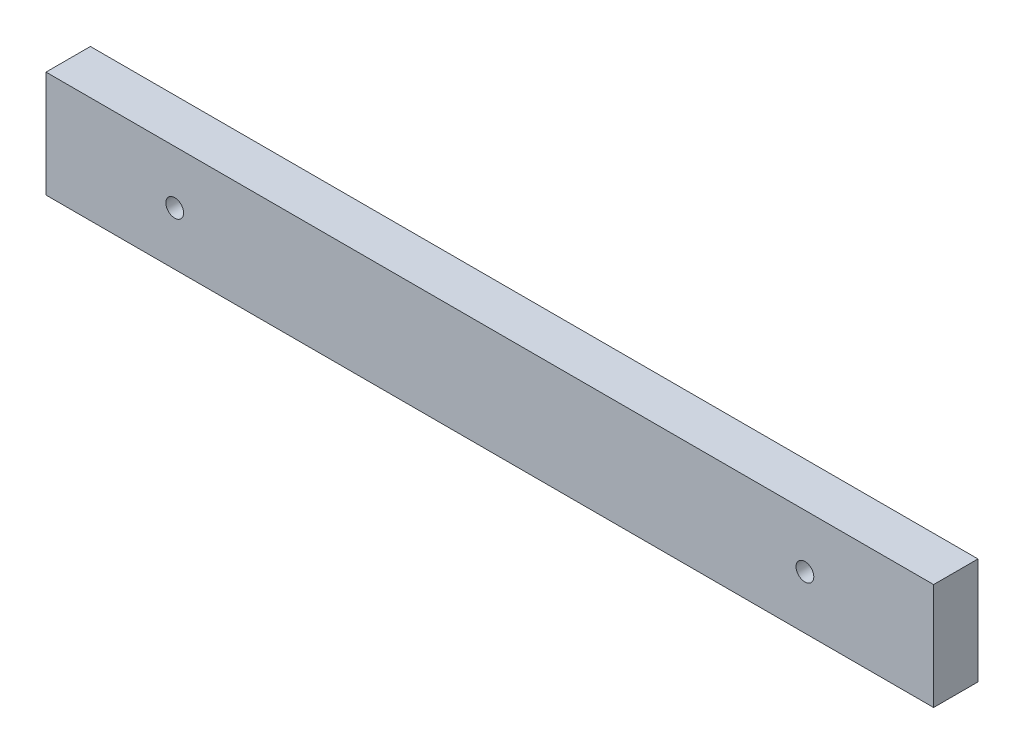
ISO-10303-21;
HEADER;
FILE_DESCRIPTION(('STEP AP214'),'2;1');
FILE_NAME('part.step','',(''),(''),'','','');
FILE_SCHEMA(('AUTOMOTIVE_DESIGN { 1 0 10303 214 1 1 1 1 }'));
ENDSEC;
DATA;
#1=APPLICATION_CONTEXT('core data for automotive mechanical design processes');
#2=APPLICATION_PROTOCOL_DEFINITION('international standard','automotive_design',2000,#1);
#3=PRODUCT_CONTEXT('',#1,'mechanical');
#4=PRODUCT('Part','Part','',(#3));
#5=PRODUCT_RELATED_PRODUCT_CATEGORY('part','',(#4));
#6=PRODUCT_DEFINITION_FORMATION('','',#4);
#7=PRODUCT_DEFINITION_CONTEXT('part definition',#1,'design');
#8=PRODUCT_DEFINITION('design','',#6,#7);
#9=PRODUCT_DEFINITION_SHAPE('','',#8);
#10=(LENGTH_UNIT() NAMED_UNIT(*) SI_UNIT(.MILLI.,.METRE.));
#11=(NAMED_UNIT(*) PLANE_ANGLE_UNIT() SI_UNIT($,.RADIAN.));
#12=(NAMED_UNIT(*) SI_UNIT($,.STERADIAN.) SOLID_ANGLE_UNIT());
#13=UNCERTAINTY_MEASURE_WITH_UNIT(LENGTH_MEASURE(1.E-05),#10,'distance_accuracy_value','');
#14=(GEOMETRIC_REPRESENTATION_CONTEXT(3) GLOBAL_UNCERTAINTY_ASSIGNED_CONTEXT((#13)) GLOBAL_UNIT_ASSIGNED_CONTEXT((#10,
#11,#12)) REPRESENTATION_CONTEXT('',''));
#15=CARTESIAN_POINT('',(0.,0.,0.));
#16=DIRECTION('',(0.,0.,1.));
#17=DIRECTION('',(1.,0.,0.));
#18=AXIS2_PLACEMENT_3D('',#15,#16,#17);
#19=CARTESIAN_POINT('',(0.,0.,5.));
#20=DIRECTION('',(1.,0.,0.));
#21=DIRECTION('',(0.,0.,-1.));
#22=AXIS2_PLACEMENT_3D('',#19,#20,#21);
#23=PLANE('',#22);
#24=DIRECTION('',(0.,-1.,0.));
#25=VECTOR('',#24,1.);
#26=CARTESIAN_POINT('',(0.,0.,0.));
#27=LINE('',#26,#25);
#28=CARTESIAN_POINT('',(0.,12.,0.));
#29=VERTEX_POINT('',#28);
#30=CARTESIAN_POINT('',(0.,0.,0.));
#31=VERTEX_POINT('',#30);
#32=EDGE_CURVE('E96',#29,#31,#27,.T.);
#33=ORIENTED_EDGE('',*,*,#32,.T.);
#34=DIRECTION('',(0.,0.,-1.));
#35=VECTOR('',#34,1.);
#36=CARTESIAN_POINT('',(0.,0.,5.));
#37=LINE('',#36,#35);
#38=CARTESIAN_POINT('',(0.,0.,5.));
#39=VERTEX_POINT('',#38);
#40=EDGE_CURVE('E11',#39,#31,#37,.T.);
#41=ORIENTED_EDGE('',*,*,#40,.F.);
#42=DIRECTION('',(0.,-1.,0.));
#43=VECTOR('',#42,1.);
#44=CARTESIAN_POINT('',(0.,0.,5.));
#45=LINE('',#44,#43);
#46=CARTESIAN_POINT('',(0.,12.,5.));
#47=VERTEX_POINT('',#46);
#48=EDGE_CURVE('E84',#47,#39,#45,.T.);
#49=ORIENTED_EDGE('',*,*,#48,.F.);
#50=DIRECTION('',(0.,0.,-1.));
#51=VECTOR('',#50,1.);
#52=CARTESIAN_POINT('',(0.,12.,5.));
#53=LINE('',#52,#51);
#54=EDGE_CURVE('E92',#47,#29,#53,.T.);
#55=ORIENTED_EDGE('',*,*,#54,.T.);
#56=EDGE_LOOP('',(#33,#41,#49,#55));
#57=FACE_BOUND('',#56,.T.);
#58=ADVANCED_FACE('F33',(#57),#23,.F.);
#59=CARTESIAN_POINT('',(0.,0.,5.));
#60=DIRECTION('',(0.,1.,0.));
#61=DIRECTION('',(0.,0.,1.));
#62=AXIS2_PLACEMENT_3D('',#59,#60,#61);
#63=PLANE('',#62);
#64=DIRECTION('',(1.,0.,0.));
#65=VECTOR('',#64,1.);
#66=CARTESIAN_POINT('',(0.,0.,0.));
#67=LINE('',#66,#65);
#68=CARTESIAN_POINT('',(100.,0.,0.));
#69=VERTEX_POINT('',#68);
#70=EDGE_CURVE('E88',#31,#69,#67,.T.);
#71=ORIENTED_EDGE('',*,*,#70,.T.);
#72=DIRECTION('',(0.,0.,-1.));
#73=VECTOR('',#72,1.);
#74=CARTESIAN_POINT('',(100.,0.,5.));
#75=LINE('',#74,#73);
#76=CARTESIAN_POINT('',(100.,0.,5.));
#77=VERTEX_POINT('',#76);
#78=EDGE_CURVE('E41',#77,#69,#75,.T.);
#79=ORIENTED_EDGE('',*,*,#78,.F.);
#80=DIRECTION('',(1.,0.,0.));
#81=VECTOR('',#80,1.);
#82=CARTESIAN_POINT('',(0.,0.,5.));
#83=LINE('',#82,#81);
#84=EDGE_CURVE('E79',#39,#77,#83,.T.);
#85=ORIENTED_EDGE('',*,*,#84,.F.);
#86=ORIENTED_EDGE('',*,*,#40,.T.);
#87=EDGE_LOOP('',(#71,#79,#85,#86));
#88=FACE_BOUND('',#87,.T.);
#89=ADVANCED_FACE('F87',(#88),#63,.F.);
#90=CARTESIAN_POINT('',(100.,0.,5.));
#91=DIRECTION('',(-1.,0.,0.));
#92=DIRECTION('',(0.,0.,1.));
#93=AXIS2_PLACEMENT_3D('',#90,#91,#92);
#94=PLANE('',#93);
#95=DIRECTION('',(0.,1.,0.));
#96=VECTOR('',#95,1.);
#97=CARTESIAN_POINT('',(100.,0.,0.));
#98=LINE('',#97,#96);
#99=CARTESIAN_POINT('',(100.,12.,0.));
#100=VERTEX_POINT('',#99);
#101=EDGE_CURVE('E66',#69,#100,#98,.T.);
#102=ORIENTED_EDGE('',*,*,#101,.T.);
#103=DIRECTION('',(0.,0.,-1.));
#104=VECTOR('',#103,1.);
#105=CARTESIAN_POINT('',(100.,12.,5.));
#106=LINE('',#105,#104);
#107=CARTESIAN_POINT('',(100.,12.,5.));
#108=VERTEX_POINT('',#107);
#109=EDGE_CURVE('E89',#108,#100,#106,.T.);
#110=ORIENTED_EDGE('',*,*,#109,.F.);
#111=DIRECTION('',(0.,1.,0.));
#112=VECTOR('',#111,1.);
#113=CARTESIAN_POINT('',(100.,0.,5.));
#114=LINE('',#113,#112);
#115=EDGE_CURVE('E82',#77,#108,#114,.T.);
#116=ORIENTED_EDGE('',*,*,#115,.F.);
#117=ORIENTED_EDGE('',*,*,#78,.T.);
#118=EDGE_LOOP('',(#102,#110,#116,#117));
#119=FACE_BOUND('',#118,.T.);
#120=ADVANCED_FACE('F90',(#119),#94,.F.);
#121=CARTESIAN_POINT('',(0.,12.,5.));
#122=DIRECTION('',(0.,-1.,0.));
#123=DIRECTION('',(0.,0.,-1.));
#124=AXIS2_PLACEMENT_3D('',#121,#122,#123);
#125=PLANE('',#124);
#126=DIRECTION('',(-1.,0.,0.));
#127=VECTOR('',#126,1.);
#128=CARTESIAN_POINT('',(0.,12.,0.));
#129=LINE('',#128,#127);
#130=EDGE_CURVE('E72',#100,#29,#129,.T.);
#131=ORIENTED_EDGE('',*,*,#130,.T.);
#132=ORIENTED_EDGE('',*,*,#54,.F.);
#133=DIRECTION('',(-1.,0.,0.));
#134=VECTOR('',#133,1.);
#135=CARTESIAN_POINT('',(0.,12.,5.));
#136=LINE('',#135,#134);
#137=EDGE_CURVE('E49',#108,#47,#136,.T.);
#138=ORIENTED_EDGE('',*,*,#137,.F.);
#139=ORIENTED_EDGE('',*,*,#109,.T.);
#140=EDGE_LOOP('',(#131,#132,#138,#139));
#141=FACE_BOUND('',#140,.T.);
#142=ADVANCED_FACE('F104',(#141),#125,.F.);
#143=CARTESIAN_POINT('',(0.,0.,5.));
#144=DIRECTION('',(0.,0.,-1.));
#145=DIRECTION('',(-1.,0.,0.));
#146=AXIS2_PLACEMENT_3D('',#143,#144,#145);
#147=PLANE('',#146);
#148=CARTESIAN_POINT('',(14.5,6.,5.));
#149=DIRECTION('',(0.,0.,1.));
#150=DIRECTION('',(1.,0.,0.));
#151=AXIS2_PLACEMENT_3D('',#148,#149,#150);
#152=CIRCLE('',#151,1.);
#153=CARTESIAN_POINT('',(15.5,6.,5.));
#154=VERTEX_POINT('',#153);
#155=EDGE_CURVE('E116',#154,#154,#152,.T.);
#156=ORIENTED_EDGE('',*,*,#155,.F.);
#157=EDGE_LOOP('',(#156));
#158=FACE_BOUND('',#157,.T.);
#159=CARTESIAN_POINT('',(85.5,6.00000000000001,5.));
#160=DIRECTION('',(0.,0.,1.));
#161=DIRECTION('',(1.,0.,0.));
#162=AXIS2_PLACEMENT_3D('',#159,#160,#161);
#163=CIRCLE('',#162,0.999999999999998);
#164=CARTESIAN_POINT('',(86.5,6.00000000000001,5.));
#165=VERTEX_POINT('',#164);
#166=EDGE_CURVE('E110',#165,#165,#163,.T.);
#167=ORIENTED_EDGE('',*,*,#166,.F.);
#168=EDGE_LOOP('',(#167));
#169=FACE_BOUND('',#168,.T.);
#170=ORIENTED_EDGE('',*,*,#48,.T.);
#171=ORIENTED_EDGE('',*,*,#84,.T.);
#172=ORIENTED_EDGE('',*,*,#115,.T.);
#173=ORIENTED_EDGE('',*,*,#137,.T.);
#174=EDGE_LOOP('',(#170,#171,#172,#173));
#175=FACE_BOUND('',#174,.T.);
#176=ADVANCED_FACE('F80',(#158,#169,#175),#147,.F.);
#177=CARTESIAN_POINT('',(0.,0.,0.));
#178=DIRECTION('',(0.,0.,-1.));
#179=DIRECTION('',(-1.,0.,0.));
#180=AXIS2_PLACEMENT_3D('',#177,#178,#179);
#181=PLANE('',#180);
#182=CARTESIAN_POINT('',(14.5,6.,0.));
#183=DIRECTION('',(0.,0.,1.));
#184=DIRECTION('',(1.,0.,0.));
#185=AXIS2_PLACEMENT_3D('',#182,#183,#184);
#186=CIRCLE('',#185,1.);
#187=CARTESIAN_POINT('',(15.5,6.,0.));
#188=VERTEX_POINT('',#187);
#189=EDGE_CURVE('E99',#188,#188,#186,.T.);
#190=ORIENTED_EDGE('',*,*,#189,.T.);
#191=EDGE_LOOP('',(#190));
#192=FACE_BOUND('',#191,.T.);
#193=CARTESIAN_POINT('',(85.5,6.00000000000001,0.));
#194=DIRECTION('',(0.,0.,1.));
#195=DIRECTION('',(1.,0.,0.));
#196=AXIS2_PLACEMENT_3D('',#193,#194,#195);
#197=CIRCLE('',#196,0.999999999999998);
#198=CARTESIAN_POINT('',(86.5,6.00000000000001,0.));
#199=VERTEX_POINT('',#198);
#200=EDGE_CURVE('E113',#199,#199,#197,.T.);
#201=ORIENTED_EDGE('',*,*,#200,.T.);
#202=EDGE_LOOP('',(#201));
#203=FACE_BOUND('',#202,.T.);
#204=ORIENTED_EDGE('',*,*,#32,.F.);
#205=ORIENTED_EDGE('',*,*,#130,.F.);
#206=ORIENTED_EDGE('',*,*,#101,.F.);
#207=ORIENTED_EDGE('',*,*,#70,.F.);
#208=EDGE_LOOP('',(#204,#205,#206,#207));
#209=FACE_BOUND('',#208,.T.);
#210=ADVANCED_FACE('F107',(#192,#203,#209),#181,.T.);
#211=CARTESIAN_POINT('',(85.5,6.00000000000001,0.));
#212=DIRECTION('',(0.,0.,1.));
#213=DIRECTION('',(1.,0.,0.));
#214=AXIS2_PLACEMENT_3D('',#211,#212,#213);
#215=CYLINDRICAL_SURFACE('',#214,0.999999999999998);
#216=ORIENTED_EDGE('',*,*,#200,.F.);
#217=EDGE_LOOP('',(#216));
#218=FACE_BOUND('',#217,.T.);
#219=ORIENTED_EDGE('',*,*,#166,.T.);
#220=EDGE_LOOP('',(#219));
#221=FACE_BOUND('',#220,.T.);
#222=ADVANCED_FACE('F127',(#218,#221),#215,.F.);
#223=CARTESIAN_POINT('',(14.5,6.,0.));
#224=DIRECTION('',(0.,0.,1.));
#225=DIRECTION('',(1.,0.,0.));
#226=AXIS2_PLACEMENT_3D('',#223,#224,#225);
#227=CYLINDRICAL_SURFACE('',#226,1.);
#228=ORIENTED_EDGE('',*,*,#189,.F.);
#229=EDGE_LOOP('',(#228));
#230=FACE_BOUND('',#229,.T.);
#231=ORIENTED_EDGE('',*,*,#155,.T.);
#232=EDGE_LOOP('',(#231));
#233=FACE_BOUND('',#232,.T.);
#234=ADVANCED_FACE('F124',(#230,#233),#227,.F.);
#235=CLOSED_SHELL('',(#58,#89,#120,#142,#176,#210,#222,#234));
#236=MANIFOLD_SOLID_BREP('B2',#235);
#237=ADVANCED_BREP_SHAPE_REPRESENTATION('',(#18,#236),#14);
#238=SHAPE_DEFINITION_REPRESENTATION(#9,#237);
ENDSEC;
END-ISO-10303-21;
